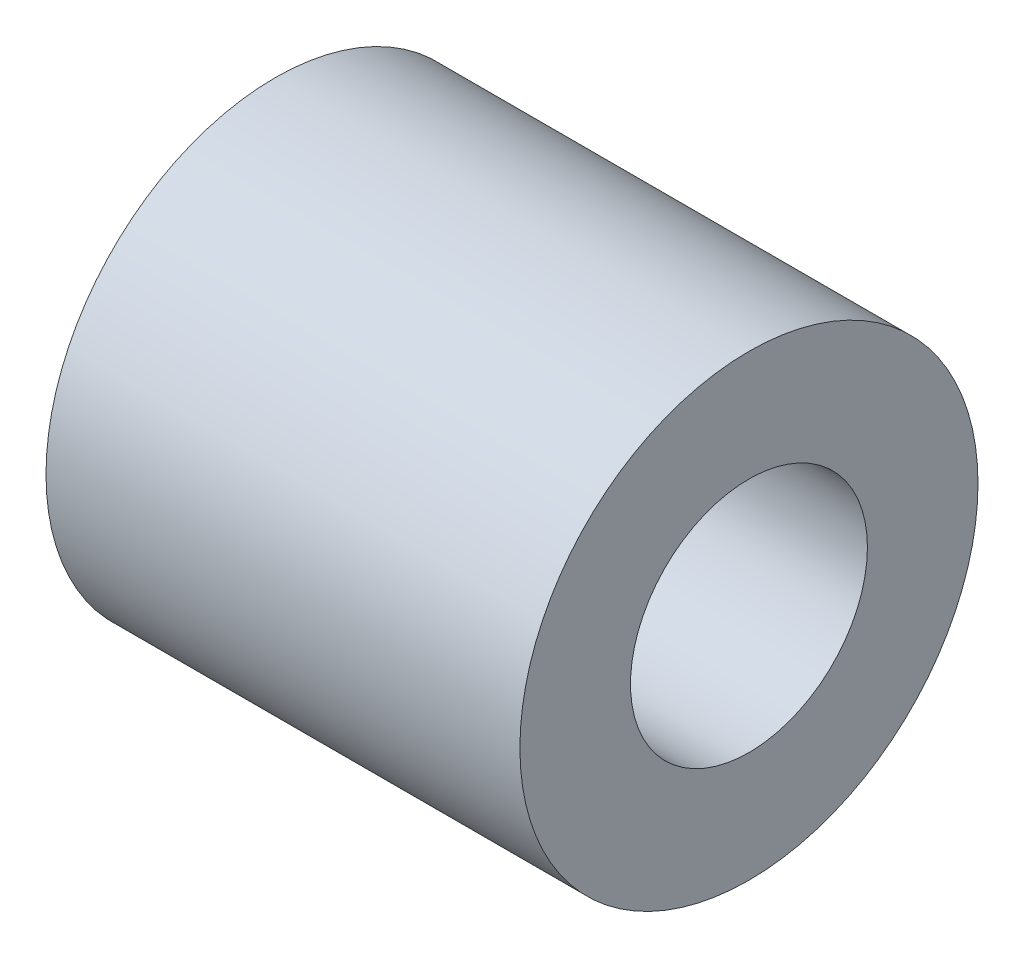
ISO-10303-21;
HEADER;
FILE_DESCRIPTION(('STEP AP214'),'2;1');
FILE_NAME('part.step','',(''),(''),'','','');
FILE_SCHEMA(('AUTOMOTIVE_DESIGN { 1 0 10303 214 1 1 1 1 }'));
ENDSEC;
DATA;
#1=APPLICATION_CONTEXT('core data for automotive mechanical design processes');
#2=APPLICATION_PROTOCOL_DEFINITION('international standard','automotive_design',2000,#1);
#3=PRODUCT_CONTEXT('',#1,'mechanical');
#4=PRODUCT('Part','Part','',(#3));
#5=PRODUCT_RELATED_PRODUCT_CATEGORY('part','',(#4));
#6=PRODUCT_DEFINITION_FORMATION('','',#4);
#7=PRODUCT_DEFINITION_CONTEXT('part definition',#1,'design');
#8=PRODUCT_DEFINITION('design','',#6,#7);
#9=PRODUCT_DEFINITION_SHAPE('','',#8);
#10=(LENGTH_UNIT() NAMED_UNIT(*) SI_UNIT(.MILLI.,.METRE.));
#11=(NAMED_UNIT(*) PLANE_ANGLE_UNIT() SI_UNIT($,.RADIAN.));
#12=(NAMED_UNIT(*) SI_UNIT($,.STERADIAN.) SOLID_ANGLE_UNIT());
#13=UNCERTAINTY_MEASURE_WITH_UNIT(LENGTH_MEASURE(1.E-05),#10,'distance_accuracy_value','');
#14=(GEOMETRIC_REPRESENTATION_CONTEXT(3) GLOBAL_UNCERTAINTY_ASSIGNED_CONTEXT((#13)) GLOBAL_UNIT_ASSIGNED_CONTEXT((#10,
#11,#12)) REPRESENTATION_CONTEXT('',''));
#15=CARTESIAN_POINT('',(0.,0.,0.));
#16=DIRECTION('',(0.,0.,1.));
#17=DIRECTION('',(1.,0.,0.));
#18=AXIS2_PLACEMENT_3D('',#15,#16,#17);
#19=CARTESIAN_POINT('',(6.,0.,0.));
#20=DIRECTION('',(1.,0.,0.));
#21=DIRECTION('',(0.,0.,-1.));
#22=AXIS2_PLACEMENT_3D('',#19,#20,#21);
#23=PLANE('',#22);
#24=CARTESIAN_POINT('',(6.,0.,0.));
#25=DIRECTION('',(1.,0.,0.));
#26=DIRECTION('',(0.,0.,-1.));
#27=AXIS2_PLACEMENT_3D('',#24,#25,#26);
#28=CIRCLE('',#27,2.9);
#29=CARTESIAN_POINT('',(6.,0.,-2.9));
#30=VERTEX_POINT('',#29);
#31=EDGE_CURVE('E10',#30,#30,#28,.T.);
#32=ORIENTED_EDGE('',*,*,#31,.T.);
#33=EDGE_LOOP('',(#32));
#34=FACE_BOUND('',#33,.T.);
#35=CARTESIAN_POINT('',(6.,0.,0.));
#36=DIRECTION('',(1.,0.,0.));
#37=DIRECTION('',(0.,0.,-1.));
#38=AXIS2_PLACEMENT_3D('',#35,#36,#37);
#39=CIRCLE('',#38,1.5);
#40=CARTESIAN_POINT('',(6.,0.,-1.5));
#41=VERTEX_POINT('',#40);
#42=EDGE_CURVE('E35',#41,#41,#39,.T.);
#43=ORIENTED_EDGE('',*,*,#42,.F.);
#44=EDGE_LOOP('',(#43));
#45=FACE_BOUND('',#44,.T.);
#46=ADVANCED_FACE('F24',(#34,#45),#23,.T.);
#47=CARTESIAN_POINT('',(0.,0.,0.));
#48=DIRECTION('',(1.,0.,0.));
#49=DIRECTION('',(0.,0.,-1.));
#50=AXIS2_PLACEMENT_3D('',#47,#48,#49);
#51=PLANE('',#50);
#52=CARTESIAN_POINT('',(0.,0.,0.));
#53=DIRECTION('',(1.,0.,0.));
#54=DIRECTION('',(0.,0.,-1.));
#55=AXIS2_PLACEMENT_3D('',#52,#53,#54);
#56=CIRCLE('',#55,2.9);
#57=CARTESIAN_POINT('',(0.,0.,-2.9));
#58=VERTEX_POINT('',#57);
#59=EDGE_CURVE('E31',#58,#58,#56,.T.);
#60=ORIENTED_EDGE('',*,*,#59,.F.);
#61=EDGE_LOOP('',(#60));
#62=FACE_BOUND('',#61,.T.);
#63=CARTESIAN_POINT('',(0.,0.,0.));
#64=DIRECTION('',(1.,0.,0.));
#65=DIRECTION('',(0.,0.,-1.));
#66=AXIS2_PLACEMENT_3D('',#63,#64,#65);
#67=CIRCLE('',#66,1.5);
#68=CARTESIAN_POINT('',(0.,0.,-1.5));
#69=VERTEX_POINT('',#68);
#70=EDGE_CURVE('E39',#69,#69,#67,.T.);
#71=ORIENTED_EDGE('',*,*,#70,.T.);
#72=EDGE_LOOP('',(#71));
#73=FACE_BOUND('',#72,.T.);
#74=ADVANCED_FACE('F45',(#62,#73),#51,.F.);
#75=CARTESIAN_POINT('',(6.,0.,0.));
#76=DIRECTION('',(-1.,0.,0.));
#77=DIRECTION('',(0.,0.,1.));
#78=AXIS2_PLACEMENT_3D('',#75,#76,#77);
#79=CYLINDRICAL_SURFACE('',#78,2.9);
#80=ORIENTED_EDGE('',*,*,#31,.F.);
#81=EDGE_LOOP('',(#80));
#82=FACE_BOUND('',#81,.T.);
#83=ORIENTED_EDGE('',*,*,#59,.T.);
#84=EDGE_LOOP('',(#83));
#85=FACE_BOUND('',#84,.T.);
#86=ADVANCED_FACE('F26',(#82,#85),#79,.T.);
#87=CARTESIAN_POINT('',(6.,0.,0.));
#88=DIRECTION('',(-1.,0.,0.));
#89=DIRECTION('',(0.,0.,1.));
#90=AXIS2_PLACEMENT_3D('',#87,#88,#89);
#91=CYLINDRICAL_SURFACE('',#90,1.5);
#92=ORIENTED_EDGE('',*,*,#42,.T.);
#93=EDGE_LOOP('',(#92));
#94=FACE_BOUND('',#93,.T.);
#95=ORIENTED_EDGE('',*,*,#70,.F.);
#96=EDGE_LOOP('',(#95));
#97=FACE_BOUND('',#96,.T.);
#98=ADVANCED_FACE('F47',(#94,#97),#91,.F.);
#99=CLOSED_SHELL('',(#46,#74,#86,#98));
#100=MANIFOLD_SOLID_BREP('B2',#99);
#101=ADVANCED_BREP_SHAPE_REPRESENTATION('',(#18,#100),#14);
#102=SHAPE_DEFINITION_REPRESENTATION(#9,#101);
ENDSEC;
END-ISO-10303-21;
